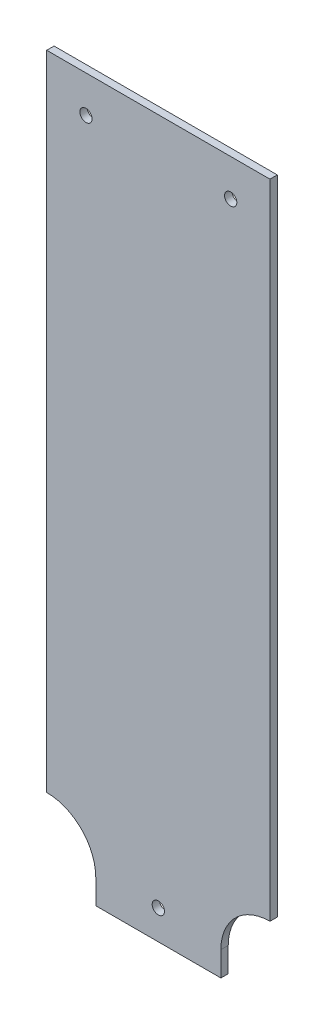
ISO-10303-21;
HEADER;
FILE_DESCRIPTION(('STEP AP214'),'2;1');
FILE_NAME('part.step','',(''),(''),'','','');
FILE_SCHEMA(('AUTOMOTIVE_DESIGN { 1 0 10303 214 1 1 1 1 }'));
ENDSEC;
DATA;
#1=APPLICATION_CONTEXT('core data for automotive mechanical design processes');
#2=APPLICATION_PROTOCOL_DEFINITION('international standard','automotive_design',2000,#1);
#3=PRODUCT_CONTEXT('',#1,'mechanical');
#4=PRODUCT('Part','Part','',(#3));
#5=PRODUCT_RELATED_PRODUCT_CATEGORY('part','',(#4));
#6=PRODUCT_DEFINITION_FORMATION('','',#4);
#7=PRODUCT_DEFINITION_CONTEXT('part definition',#1,'design');
#8=PRODUCT_DEFINITION('design','',#6,#7);
#9=PRODUCT_DEFINITION_SHAPE('','',#8);
#10=(LENGTH_UNIT() NAMED_UNIT(*) SI_UNIT(.MILLI.,.METRE.));
#11=(NAMED_UNIT(*) PLANE_ANGLE_UNIT() SI_UNIT($,.RADIAN.));
#12=(NAMED_UNIT(*) SI_UNIT($,.STERADIAN.) SOLID_ANGLE_UNIT());
#13=UNCERTAINTY_MEASURE_WITH_UNIT(LENGTH_MEASURE(1.E-05),#10,'distance_accuracy_value','');
#14=(GEOMETRIC_REPRESENTATION_CONTEXT(3) GLOBAL_UNCERTAINTY_ASSIGNED_CONTEXT((#13)) GLOBAL_UNIT_ASSIGNED_CONTEXT((#10,
#11,#12)) REPRESENTATION_CONTEXT('',''));
#15=CARTESIAN_POINT('',(0.,0.,0.));
#16=DIRECTION('',(0.,0.,1.));
#17=DIRECTION('',(1.,0.,0.));
#18=AXIS2_PLACEMENT_3D('',#15,#16,#17);
#19=CARTESIAN_POINT('',(-45.5,9.99999999999999,3.));
#20=DIRECTION('',(0.,0.,-1.));
#21=DIRECTION('',(-1.,0.,0.));
#22=AXIS2_PLACEMENT_3D('',#19,#20,#21);
#23=PLANE('',#22);
#24=CARTESIAN_POINT('',(29.5,277.,3.));
#25=DIRECTION('',(0.,0.,1.));
#26=DIRECTION('',(-1.,0.,0.));
#27=AXIS2_PLACEMENT_3D('',#24,#25,#26);
#28=CIRCLE('',#27,2.5);
#29=CARTESIAN_POINT('',(27.,277.,3.));
#30=VERTEX_POINT('',#29);
#31=EDGE_CURVE('E180',#30,#30,#28,.T.);
#32=ORIENTED_EDGE('',*,*,#31,.F.);
#33=EDGE_LOOP('',(#32));
#34=FACE_BOUND('',#33,.T.);
#35=DIRECTION('',(0.,-1.,0.));
#36=VECTOR('',#35,1.);
#37=CARTESIAN_POINT('',(-45.5,292.,3.));
#38=LINE('',#37,#36);
#39=CARTESIAN_POINT('',(-45.5,292.,3.));
#40=VERTEX_POINT('',#39);
#41=CARTESIAN_POINT('',(-45.5,30.,3.));
#42=VERTEX_POINT('',#41);
#43=EDGE_CURVE('E143',#40,#42,#38,.T.);
#44=ORIENTED_EDGE('',*,*,#43,.T.);
#45=CARTESIAN_POINT('',(-45.5,9.99999999999999,3.));
#46=DIRECTION('',(0.,0.,-1.));
#47=DIRECTION('',(-1.,0.,0.));
#48=AXIS2_PLACEMENT_3D('',#45,#46,#47);
#49=CIRCLE('',#48,20.);
#50=CARTESIAN_POINT('',(-25.5,9.99999999999999,3.));
#51=VERTEX_POINT('',#50);
#52=EDGE_CURVE('E91',#42,#51,#49,.T.);
#53=ORIENTED_EDGE('',*,*,#52,.T.);
#54=DIRECTION('',(0.,-1.,0.));
#55=VECTOR('',#54,1.);
#56=CARTESIAN_POINT('',(-25.5,0.,3.));
#57=LINE('',#56,#55);
#58=CARTESIAN_POINT('',(-25.5,0.,3.));
#59=VERTEX_POINT('',#58);
#60=EDGE_CURVE('E158',#51,#59,#57,.T.);
#61=ORIENTED_EDGE('',*,*,#60,.T.);
#62=DIRECTION('',(1.,0.,0.));
#63=VECTOR('',#62,1.);
#64=CARTESIAN_POINT('',(25.5,0.,3.));
#65=LINE('',#64,#63);
#66=CARTESIAN_POINT('',(25.5,0.,3.));
#67=VERTEX_POINT('',#66);
#68=EDGE_CURVE('E171',#59,#67,#65,.T.);
#69=ORIENTED_EDGE('',*,*,#68,.T.);
#70=DIRECTION('',(0.,1.,0.));
#71=VECTOR('',#70,1.);
#72=CARTESIAN_POINT('',(25.5,0.,3.));
#73=LINE('',#72,#71);
#74=CARTESIAN_POINT('',(25.5,9.99999999999999,3.));
#75=VERTEX_POINT('',#74);
#76=EDGE_CURVE('E110',#67,#75,#73,.T.);
#77=ORIENTED_EDGE('',*,*,#76,.T.);
#78=CARTESIAN_POINT('',(45.5,9.99999999999999,3.));
#79=DIRECTION('',(0.,0.,-1.));
#80=DIRECTION('',(1.,0.,0.));
#81=AXIS2_PLACEMENT_3D('',#78,#79,#80);
#82=CIRCLE('',#81,20.);
#83=CARTESIAN_POINT('',(45.5,30.,3.));
#84=VERTEX_POINT('',#83);
#85=EDGE_CURVE('E104',#75,#84,#82,.T.);
#86=ORIENTED_EDGE('',*,*,#85,.T.);
#87=DIRECTION('',(0.,1.,0.));
#88=VECTOR('',#87,1.);
#89=CARTESIAN_POINT('',(45.5,292.,3.));
#90=LINE('',#89,#88);
#91=CARTESIAN_POINT('',(45.5,292.,3.));
#92=VERTEX_POINT('',#91);
#93=EDGE_CURVE('E108',#84,#92,#90,.T.);
#94=ORIENTED_EDGE('',*,*,#93,.T.);
#95=DIRECTION('',(-1.,0.,0.));
#96=VECTOR('',#95,1.);
#97=CARTESIAN_POINT('',(45.5,292.,3.));
#98=LINE('',#97,#96);
#99=EDGE_CURVE('E48',#92,#40,#98,.T.);
#100=ORIENTED_EDGE('',*,*,#99,.T.);
#101=EDGE_LOOP('',(#44,#53,#61,#69,#77,#86,#94,#100));
#102=FACE_BOUND('',#101,.T.);
#103=CARTESIAN_POINT('',(-29.5,277.,3.));
#104=DIRECTION('',(0.,0.,1.));
#105=DIRECTION('',(1.,0.,0.));
#106=AXIS2_PLACEMENT_3D('',#103,#104,#105);
#107=CIRCLE('',#106,2.5);
#108=CARTESIAN_POINT('',(-27.,277.,3.));
#109=VERTEX_POINT('',#108);
#110=EDGE_CURVE('E132',#109,#109,#107,.T.);
#111=ORIENTED_EDGE('',*,*,#110,.F.);
#112=EDGE_LOOP('',(#111));
#113=FACE_BOUND('',#112,.T.);
#114=CARTESIAN_POINT('',(0.,12.,3.));
#115=DIRECTION('',(0.,0.,1.));
#116=DIRECTION('',(1.,0.,0.));
#117=AXIS2_PLACEMENT_3D('',#114,#115,#116);
#118=CIRCLE('',#117,2.5);
#119=CARTESIAN_POINT('',(2.5,12.,3.));
#120=VERTEX_POINT('',#119);
#121=EDGE_CURVE('E186',#120,#120,#118,.T.);
#122=ORIENTED_EDGE('',*,*,#121,.F.);
#123=EDGE_LOOP('',(#122));
#124=FACE_BOUND('',#123,.T.);
#125=ADVANCED_FACE('F31',(#34,#102,#113,#124),#23,.F.);
#126=CARTESIAN_POINT('',(-45.5,9.99999999999999,0.));
#127=DIRECTION('',(0.,0.,-1.));
#128=DIRECTION('',(-1.,0.,0.));
#129=AXIS2_PLACEMENT_3D('',#126,#127,#128);
#130=PLANE('',#129);
#131=CARTESIAN_POINT('',(29.5,277.,0.));
#132=DIRECTION('',(0.,0.,1.));
#133=DIRECTION('',(-1.,0.,0.));
#134=AXIS2_PLACEMENT_3D('',#131,#132,#133);
#135=CIRCLE('',#134,2.5);
#136=CARTESIAN_POINT('',(27.,277.,0.));
#137=VERTEX_POINT('',#136);
#138=EDGE_CURVE('E183',#137,#137,#135,.T.);
#139=ORIENTED_EDGE('',*,*,#138,.T.);
#140=EDGE_LOOP('',(#139));
#141=FACE_BOUND('',#140,.T.);
#142=DIRECTION('',(0.,-1.,0.));
#143=VECTOR('',#142,1.);
#144=CARTESIAN_POINT('',(-45.5,292.,0.));
#145=LINE('',#144,#143);
#146=CARTESIAN_POINT('',(-45.5,292.,0.));
#147=VERTEX_POINT('',#146);
#148=CARTESIAN_POINT('',(-45.5,30.,0.));
#149=VERTEX_POINT('',#148);
#150=EDGE_CURVE('E128',#147,#149,#145,.T.);
#151=ORIENTED_EDGE('',*,*,#150,.F.);
#152=DIRECTION('',(-1.,0.,0.));
#153=VECTOR('',#152,1.);
#154=CARTESIAN_POINT('',(45.5,292.,0.));
#155=LINE('',#154,#153);
#156=CARTESIAN_POINT('',(45.5,292.,0.));
#157=VERTEX_POINT('',#156);
#158=EDGE_CURVE('E83',#157,#147,#155,.T.);
#159=ORIENTED_EDGE('',*,*,#158,.F.);
#160=DIRECTION('',(0.,1.,0.));
#161=VECTOR('',#160,1.);
#162=CARTESIAN_POINT('',(45.5,292.,0.));
#163=LINE('',#162,#161);
#164=CARTESIAN_POINT('',(45.5,30.,0.));
#165=VERTEX_POINT('',#164);
#166=EDGE_CURVE('E77',#165,#157,#163,.T.);
#167=ORIENTED_EDGE('',*,*,#166,.F.);
#168=CARTESIAN_POINT('',(45.5,9.99999999999999,0.));
#169=DIRECTION('',(0.,0.,-1.));
#170=DIRECTION('',(1.,0.,0.));
#171=AXIS2_PLACEMENT_3D('',#168,#169,#170);
#172=CIRCLE('',#171,20.);
#173=CARTESIAN_POINT('',(25.5,9.99999999999999,0.));
#174=VERTEX_POINT('',#173);
#175=EDGE_CURVE('E118',#174,#165,#172,.T.);
#176=ORIENTED_EDGE('',*,*,#175,.F.);
#177=DIRECTION('',(0.,1.,0.));
#178=VECTOR('',#177,1.);
#179=CARTESIAN_POINT('',(25.5,0.,0.));
#180=LINE('',#179,#178);
#181=CARTESIAN_POINT('',(25.5,0.,0.));
#182=VERTEX_POINT('',#181);
#183=EDGE_CURVE('E138',#182,#174,#180,.T.);
#184=ORIENTED_EDGE('',*,*,#183,.F.);
#185=DIRECTION('',(1.,0.,0.));
#186=VECTOR('',#185,1.);
#187=CARTESIAN_POINT('',(25.5,0.,0.));
#188=LINE('',#187,#186);
#189=CARTESIAN_POINT('',(-25.5,0.,0.));
#190=VERTEX_POINT('',#189);
#191=EDGE_CURVE('E136',#190,#182,#188,.T.);
#192=ORIENTED_EDGE('',*,*,#191,.F.);
#193=DIRECTION('',(0.,-1.,0.));
#194=VECTOR('',#193,1.);
#195=CARTESIAN_POINT('',(-25.5,0.,0.));
#196=LINE('',#195,#194);
#197=CARTESIAN_POINT('',(-25.5,9.99999999999999,0.));
#198=VERTEX_POINT('',#197);
#199=EDGE_CURVE('E134',#198,#190,#196,.T.);
#200=ORIENTED_EDGE('',*,*,#199,.F.);
#201=CARTESIAN_POINT('',(-45.5,9.99999999999999,0.));
#202=DIRECTION('',(0.,0.,-1.));
#203=DIRECTION('',(-1.,0.,0.));
#204=AXIS2_PLACEMENT_3D('',#201,#202,#203);
#205=CIRCLE('',#204,20.);
#206=EDGE_CURVE('E131',#149,#198,#205,.T.);
#207=ORIENTED_EDGE('',*,*,#206,.F.);
#208=EDGE_LOOP('',(#151,#159,#167,#176,#184,#192,#200,#207));
#209=FACE_BOUND('',#208,.T.);
#210=CARTESIAN_POINT('',(-29.5,277.,0.));
#211=DIRECTION('',(0.,0.,1.));
#212=DIRECTION('',(1.,0.,0.));
#213=AXIS2_PLACEMENT_3D('',#210,#211,#212);
#214=CIRCLE('',#213,2.5);
#215=CARTESIAN_POINT('',(-27.,277.,0.));
#216=VERTEX_POINT('',#215);
#217=EDGE_CURVE('E177',#216,#216,#214,.T.);
#218=ORIENTED_EDGE('',*,*,#217,.T.);
#219=EDGE_LOOP('',(#218));
#220=FACE_BOUND('',#219,.T.);
#221=CARTESIAN_POINT('',(0.,12.,0.));
#222=DIRECTION('',(0.,0.,1.));
#223=DIRECTION('',(1.,0.,0.));
#224=AXIS2_PLACEMENT_3D('',#221,#222,#223);
#225=CIRCLE('',#224,2.5);
#226=CARTESIAN_POINT('',(2.5,12.,0.));
#227=VERTEX_POINT('',#226);
#228=EDGE_CURVE('E189',#227,#227,#225,.T.);
#229=ORIENTED_EDGE('',*,*,#228,.T.);
#230=EDGE_LOOP('',(#229));
#231=FACE_BOUND('',#230,.T.);
#232=ADVANCED_FACE('F162',(#141,#209,#220,#231),#130,.T.);
#233=CARTESIAN_POINT('',(-45.5,292.,3.));
#234=DIRECTION('',(1.,0.,0.));
#235=DIRECTION('',(0.,1.,0.));
#236=AXIS2_PLACEMENT_3D('',#233,#234,#235);
#237=PLANE('',#236);
#238=ORIENTED_EDGE('',*,*,#150,.T.);
#239=DIRECTION('',(0.,0.,-1.));
#240=VECTOR('',#239,1.);
#241=CARTESIAN_POINT('',(-45.5,30.,3.));
#242=LINE('',#241,#240);
#243=EDGE_CURVE('E11',#42,#149,#242,.T.);
#244=ORIENTED_EDGE('',*,*,#243,.F.);
#245=ORIENTED_EDGE('',*,*,#43,.F.);
#246=DIRECTION('',(0.,0.,-1.));
#247=VECTOR('',#246,1.);
#248=CARTESIAN_POINT('',(-45.5,292.,3.));
#249=LINE('',#248,#247);
#250=EDGE_CURVE('E124',#40,#147,#249,.T.);
#251=ORIENTED_EDGE('',*,*,#250,.T.);
#252=EDGE_LOOP('',(#238,#244,#245,#251));
#253=FACE_BOUND('',#252,.T.);
#254=ADVANCED_FACE('F33',(#253),#237,.F.);
#255=CARTESIAN_POINT('',(-45.5,9.99999999999999,3.));
#256=DIRECTION('',(0.,0.,-1.));
#257=DIRECTION('',(-1.,0.,0.));
#258=AXIS2_PLACEMENT_3D('',#255,#256,#257);
#259=CYLINDRICAL_SURFACE('',#258,20.);
#260=ORIENTED_EDGE('',*,*,#206,.T.);
#261=DIRECTION('',(0.,0.,-1.));
#262=VECTOR('',#261,1.);
#263=CARTESIAN_POINT('',(-25.5,9.99999999999999,3.));
#264=LINE('',#263,#262);
#265=EDGE_CURVE('E40',#51,#198,#264,.T.);
#266=ORIENTED_EDGE('',*,*,#265,.F.);
#267=ORIENTED_EDGE('',*,*,#52,.F.);
#268=ORIENTED_EDGE('',*,*,#243,.T.);
#269=EDGE_LOOP('',(#260,#266,#267,#268));
#270=FACE_BOUND('',#269,.T.);
#271=ADVANCED_FACE('F223',(#270),#259,.F.);
#272=CARTESIAN_POINT('',(-25.5,0.,3.));
#273=DIRECTION('',(1.,0.,0.));
#274=DIRECTION('',(0.,0.,-1.));
#275=AXIS2_PLACEMENT_3D('',#272,#273,#274);
#276=PLANE('',#275);
#277=ORIENTED_EDGE('',*,*,#199,.T.);
#278=DIRECTION('',(0.,0.,-1.));
#279=VECTOR('',#278,1.);
#280=CARTESIAN_POINT('',(-25.5,0.,3.));
#281=LINE('',#280,#279);
#282=EDGE_CURVE('E150',#59,#190,#281,.T.);
#283=ORIENTED_EDGE('',*,*,#282,.F.);
#284=ORIENTED_EDGE('',*,*,#60,.F.);
#285=ORIENTED_EDGE('',*,*,#265,.T.);
#286=EDGE_LOOP('',(#277,#283,#284,#285));
#287=FACE_BOUND('',#286,.T.);
#288=ADVANCED_FACE('F156',(#287),#276,.F.);
#289=CARTESIAN_POINT('',(25.5,0.,3.));
#290=DIRECTION('',(0.,1.,0.));
#291=DIRECTION('',(0.,0.,1.));
#292=AXIS2_PLACEMENT_3D('',#289,#290,#291);
#293=PLANE('',#292);
#294=ORIENTED_EDGE('',*,*,#191,.T.);
#295=DIRECTION('',(0.,0.,-1.));
#296=VECTOR('',#295,1.);
#297=CARTESIAN_POINT('',(25.5,0.,3.));
#298=LINE('',#297,#296);
#299=EDGE_CURVE('E147',#67,#182,#298,.T.);
#300=ORIENTED_EDGE('',*,*,#299,.F.);
#301=ORIENTED_EDGE('',*,*,#68,.F.);
#302=ORIENTED_EDGE('',*,*,#282,.T.);
#303=EDGE_LOOP('',(#294,#300,#301,#302));
#304=FACE_BOUND('',#303,.T.);
#305=ADVANCED_FACE('F167',(#304),#293,.F.);
#306=CARTESIAN_POINT('',(25.5,0.,3.));
#307=DIRECTION('',(-1.,0.,0.));
#308=DIRECTION('',(0.,0.,1.));
#309=AXIS2_PLACEMENT_3D('',#306,#307,#308);
#310=PLANE('',#309);
#311=ORIENTED_EDGE('',*,*,#183,.T.);
#312=DIRECTION('',(0.,0.,-1.));
#313=VECTOR('',#312,1.);
#314=CARTESIAN_POINT('',(25.5,9.99999999999999,3.));
#315=LINE('',#314,#313);
#316=EDGE_CURVE('E119',#75,#174,#315,.T.);
#317=ORIENTED_EDGE('',*,*,#316,.F.);
#318=ORIENTED_EDGE('',*,*,#76,.F.);
#319=ORIENTED_EDGE('',*,*,#299,.T.);
#320=EDGE_LOOP('',(#311,#317,#318,#319));
#321=FACE_BOUND('',#320,.T.);
#322=ADVANCED_FACE('F170',(#321),#310,.F.);
#323=CARTESIAN_POINT('',(45.5,9.99999999999999,3.));
#324=DIRECTION('',(0.,0.,-1.));
#325=DIRECTION('',(-1.,0.,0.));
#326=AXIS2_PLACEMENT_3D('',#323,#324,#325);
#327=CYLINDRICAL_SURFACE('',#326,20.);
#328=ORIENTED_EDGE('',*,*,#175,.T.);
#329=DIRECTION('',(0.,0.,-1.));
#330=VECTOR('',#329,1.);
#331=CARTESIAN_POINT('',(45.5,30.,3.));
#332=LINE('',#331,#330);
#333=EDGE_CURVE('E115',#84,#165,#332,.T.);
#334=ORIENTED_EDGE('',*,*,#333,.F.);
#335=ORIENTED_EDGE('',*,*,#85,.F.);
#336=ORIENTED_EDGE('',*,*,#316,.T.);
#337=EDGE_LOOP('',(#328,#334,#335,#336));
#338=FACE_BOUND('',#337,.T.);
#339=ADVANCED_FACE('F116',(#338),#327,.F.);
#340=CARTESIAN_POINT('',(45.5,292.,3.));
#341=DIRECTION('',(-1.,0.,0.));
#342=DIRECTION('',(0.,-1.,0.));
#343=AXIS2_PLACEMENT_3D('',#340,#341,#342);
#344=PLANE('',#343);
#345=ORIENTED_EDGE('',*,*,#166,.T.);
#346=DIRECTION('',(0.,0.,-1.));
#347=VECTOR('',#346,1.);
#348=CARTESIAN_POINT('',(45.5,292.,3.));
#349=LINE('',#348,#347);
#350=EDGE_CURVE('E120',#92,#157,#349,.T.);
#351=ORIENTED_EDGE('',*,*,#350,.F.);
#352=ORIENTED_EDGE('',*,*,#93,.F.);
#353=ORIENTED_EDGE('',*,*,#333,.T.);
#354=EDGE_LOOP('',(#345,#351,#352,#353));
#355=FACE_BOUND('',#354,.T.);
#356=ADVANCED_FACE('F122',(#355),#344,.F.);
#357=CARTESIAN_POINT('',(45.5,292.,3.));
#358=DIRECTION('',(0.,-1.,0.));
#359=DIRECTION('',(0.,0.,-1.));
#360=AXIS2_PLACEMENT_3D('',#357,#358,#359);
#361=PLANE('',#360);
#362=ORIENTED_EDGE('',*,*,#158,.T.);
#363=ORIENTED_EDGE('',*,*,#250,.F.);
#364=ORIENTED_EDGE('',*,*,#99,.F.);
#365=ORIENTED_EDGE('',*,*,#350,.T.);
#366=EDGE_LOOP('',(#362,#363,#364,#365));
#367=FACE_BOUND('',#366,.T.);
#368=ADVANCED_FACE('F211',(#367),#361,.F.);
#369=CARTESIAN_POINT('',(-29.5,277.,3.));
#370=DIRECTION('',(0.,0.,-1.));
#371=DIRECTION('',(-1.,0.,0.));
#372=AXIS2_PLACEMENT_3D('',#369,#370,#371);
#373=CYLINDRICAL_SURFACE('',#372,2.5);
#374=ORIENTED_EDGE('',*,*,#110,.T.);
#375=EDGE_LOOP('',(#374));
#376=FACE_BOUND('',#375,.T.);
#377=ORIENTED_EDGE('',*,*,#217,.F.);
#378=EDGE_LOOP('',(#377));
#379=FACE_BOUND('',#378,.T.);
#380=ADVANCED_FACE('F208',(#376,#379),#373,.F.);
#381=CARTESIAN_POINT('',(29.5,277.,3.));
#382=DIRECTION('',(0.,0.,-1.));
#383=DIRECTION('',(-1.,0.,0.));
#384=AXIS2_PLACEMENT_3D('',#381,#382,#383);
#385=CYLINDRICAL_SURFACE('',#384,2.5);
#386=ORIENTED_EDGE('',*,*,#31,.T.);
#387=EDGE_LOOP('',(#386));
#388=FACE_BOUND('',#387,.T.);
#389=ORIENTED_EDGE('',*,*,#138,.F.);
#390=EDGE_LOOP('',(#389));
#391=FACE_BOUND('',#390,.T.);
#392=ADVANCED_FACE('F287',(#388,#391),#385,.F.);
#393=CARTESIAN_POINT('',(0.,12.,3.));
#394=DIRECTION('',(0.,0.,-1.));
#395=DIRECTION('',(-1.,0.,0.));
#396=AXIS2_PLACEMENT_3D('',#393,#394,#395);
#397=CYLINDRICAL_SURFACE('',#396,2.5);
#398=ORIENTED_EDGE('',*,*,#121,.T.);
#399=EDGE_LOOP('',(#398));
#400=FACE_BOUND('',#399,.T.);
#401=ORIENTED_EDGE('',*,*,#228,.F.);
#402=EDGE_LOOP('',(#401));
#403=FACE_BOUND('',#402,.T.);
#404=ADVANCED_FACE('F195',(#400,#403),#397,.F.);
#405=CLOSED_SHELL('',(#125,#232,#254,#271,#288,#305,#322,#339,#356,#368,#380,#392,#404));
#406=MANIFOLD_SOLID_BREP('B2',#405);
#407=ADVANCED_BREP_SHAPE_REPRESENTATION('',(#18,#406),#14);
#408=SHAPE_DEFINITION_REPRESENTATION(#9,#407);
ENDSEC;
END-ISO-10303-21;
